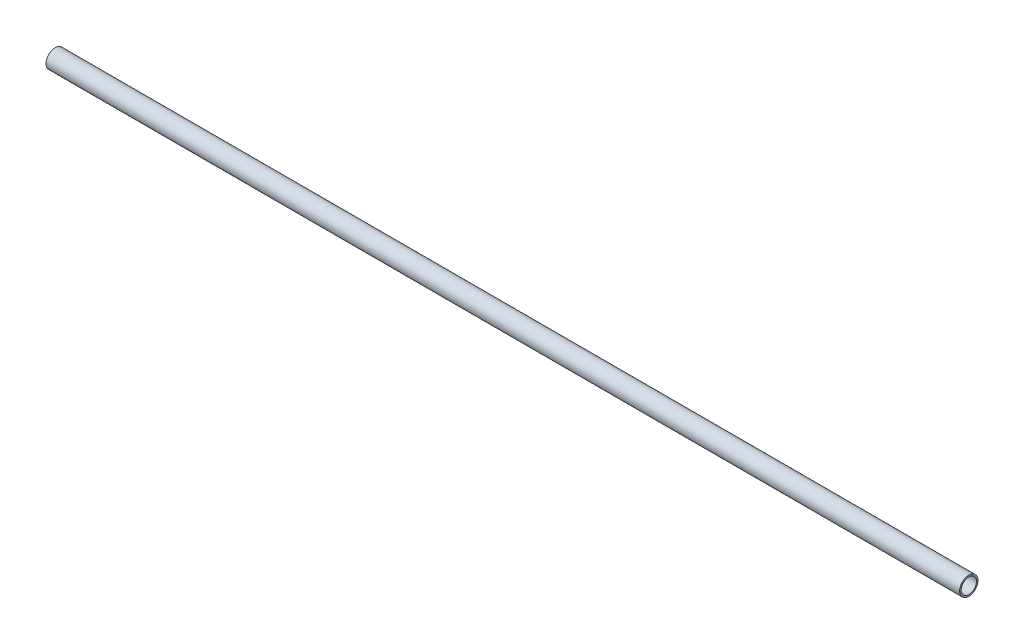
ISO-10303-21;
HEADER;
FILE_DESCRIPTION(('STEP AP214'),'2;1');
FILE_NAME('part.step','',(''),(''),'','','');
FILE_SCHEMA(('AUTOMOTIVE_DESIGN { 1 0 10303 214 1 1 1 1 }'));
ENDSEC;
DATA;
#1=APPLICATION_CONTEXT('core data for automotive mechanical design processes');
#2=APPLICATION_PROTOCOL_DEFINITION('international standard','automotive_design',2000,#1);
#3=PRODUCT_CONTEXT('',#1,'mechanical');
#4=PRODUCT('Part','Part','',(#3));
#5=PRODUCT_RELATED_PRODUCT_CATEGORY('part','',(#4));
#6=PRODUCT_DEFINITION_FORMATION('','',#4);
#7=PRODUCT_DEFINITION_CONTEXT('part definition',#1,'design');
#8=PRODUCT_DEFINITION('design','',#6,#7);
#9=PRODUCT_DEFINITION_SHAPE('','',#8);
#10=(LENGTH_UNIT() NAMED_UNIT(*) SI_UNIT(.MILLI.,.METRE.));
#11=(NAMED_UNIT(*) PLANE_ANGLE_UNIT() SI_UNIT($,.RADIAN.));
#12=(NAMED_UNIT(*) SI_UNIT($,.STERADIAN.) SOLID_ANGLE_UNIT());
#13=UNCERTAINTY_MEASURE_WITH_UNIT(LENGTH_MEASURE(1.E-05),#10,'distance_accuracy_value','');
#14=(GEOMETRIC_REPRESENTATION_CONTEXT(3) GLOBAL_UNCERTAINTY_ASSIGNED_CONTEXT((#13)) GLOBAL_UNIT_ASSIGNED_CONTEXT((#10,
#11,#12)) REPRESENTATION_CONTEXT('',''));
#15=CARTESIAN_POINT('',(0.,0.,0.));
#16=DIRECTION('',(0.,0.,1.));
#17=DIRECTION('',(1.,0.,0.));
#18=AXIS2_PLACEMENT_3D('',#15,#16,#17);
#19=CARTESIAN_POINT('',(0.,0.,0.));
#20=DIRECTION('',(1.,0.,0.));
#21=DIRECTION('',(0.,0.,-1.));
#22=AXIS2_PLACEMENT_3D('',#19,#20,#21);
#23=CYLINDRICAL_SURFACE('',#22,17.526);
#24=CARTESIAN_POINT('',(2095.5,0.,0.));
#25=DIRECTION('',(1.,0.,0.));
#26=DIRECTION('',(0.,0.,-1.));
#27=AXIS2_PLACEMENT_3D('',#24,#25,#26);
#28=CIRCLE('',#27,17.526);
#29=CARTESIAN_POINT('',(2095.5,0.,-17.526));
#30=VERTEX_POINT('',#29);
#31=EDGE_CURVE('E17',#30,#30,#28,.F.);
#32=ORIENTED_EDGE('',*,*,#31,.F.);
#33=EDGE_LOOP('',(#32));
#34=FACE_BOUND('',#33,.T.);
#35=CARTESIAN_POINT('',(0.,0.,0.));
#36=DIRECTION('',(1.,0.,0.));
#37=DIRECTION('',(0.,0.,-1.));
#38=AXIS2_PLACEMENT_3D('',#35,#36,#37);
#39=CIRCLE('',#38,17.526);
#40=CARTESIAN_POINT('',(0.,0.,-17.526));
#41=VERTEX_POINT('',#40);
#42=EDGE_CURVE('E26',#41,#41,#39,.F.);
#43=ORIENTED_EDGE('',*,*,#42,.T.);
#44=EDGE_LOOP('',(#43));
#45=FACE_BOUND('',#44,.T.);
#46=ADVANCED_FACE('F14',(#34,#45),#23,.F.);
#47=CARTESIAN_POINT('',(2095.5,0.,0.));
#48=DIRECTION('',(1.,0.,0.));
#49=DIRECTION('',(0.,0.,-1.));
#50=AXIS2_PLACEMENT_3D('',#47,#48,#49);
#51=PLANE('',#50);
#52=ORIENTED_EDGE('',*,*,#31,.T.);
#53=EDGE_LOOP('',(#52));
#54=FACE_BOUND('',#53,.T.);
#55=CARTESIAN_POINT('',(2095.5,0.,0.));
#56=DIRECTION('',(1.,0.,0.));
#57=DIRECTION('',(0.,0.,-1.));
#58=AXIS2_PLACEMENT_3D('',#55,#56,#57);
#59=CIRCLE('',#58,21.082);
#60=CARTESIAN_POINT('',(2095.5,0.,-21.082));
#61=VERTEX_POINT('',#60);
#62=EDGE_CURVE('E21',#61,#61,#59,.F.);
#63=ORIENTED_EDGE('',*,*,#62,.F.);
#64=EDGE_LOOP('',(#63));
#65=FACE_BOUND('',#64,.T.);
#66=ADVANCED_FACE('F34',(#54,#65),#51,.T.);
#67=CARTESIAN_POINT('',(0.,0.,0.));
#68=DIRECTION('',(1.,0.,0.));
#69=DIRECTION('',(0.,0.,-1.));
#70=AXIS2_PLACEMENT_3D('',#67,#68,#69);
#71=PLANE('',#70);
#72=ORIENTED_EDGE('',*,*,#42,.F.);
#73=EDGE_LOOP('',(#72));
#74=FACE_BOUND('',#73,.T.);
#75=CARTESIAN_POINT('',(0.,0.,0.));
#76=DIRECTION('',(1.,0.,0.));
#77=DIRECTION('',(0.,0.,-1.));
#78=AXIS2_PLACEMENT_3D('',#75,#76,#77);
#79=CIRCLE('',#78,21.082);
#80=CARTESIAN_POINT('',(0.,0.,-21.082));
#81=VERTEX_POINT('',#80);
#82=EDGE_CURVE('E10',#81,#81,#79,.T.);
#83=ORIENTED_EDGE('',*,*,#82,.F.);
#84=EDGE_LOOP('',(#83));
#85=FACE_BOUND('',#84,.T.);
#86=ADVANCED_FACE('F42',(#74,#85),#71,.F.);
#87=CARTESIAN_POINT('',(0.,0.,0.));
#88=DIRECTION('',(1.,0.,0.));
#89=DIRECTION('',(0.,0.,-1.));
#90=AXIS2_PLACEMENT_3D('',#87,#88,#89);
#91=CYLINDRICAL_SURFACE('',#90,21.082);
#92=ORIENTED_EDGE('',*,*,#62,.T.);
#93=EDGE_LOOP('',(#92));
#94=FACE_BOUND('',#93,.T.);
#95=ORIENTED_EDGE('',*,*,#82,.T.);
#96=EDGE_LOOP('',(#95));
#97=FACE_BOUND('',#96,.T.);
#98=ADVANCED_FACE('F43',(#94,#97),#91,.T.);
#99=CLOSED_SHELL('',(#46,#66,#86,#98));
#100=MANIFOLD_SOLID_BREP('B1',#99);
#101=ADVANCED_BREP_SHAPE_REPRESENTATION('',(#18,#100),#14);
#102=SHAPE_DEFINITION_REPRESENTATION(#9,#101);
ENDSEC;
END-ISO-10303-21;
